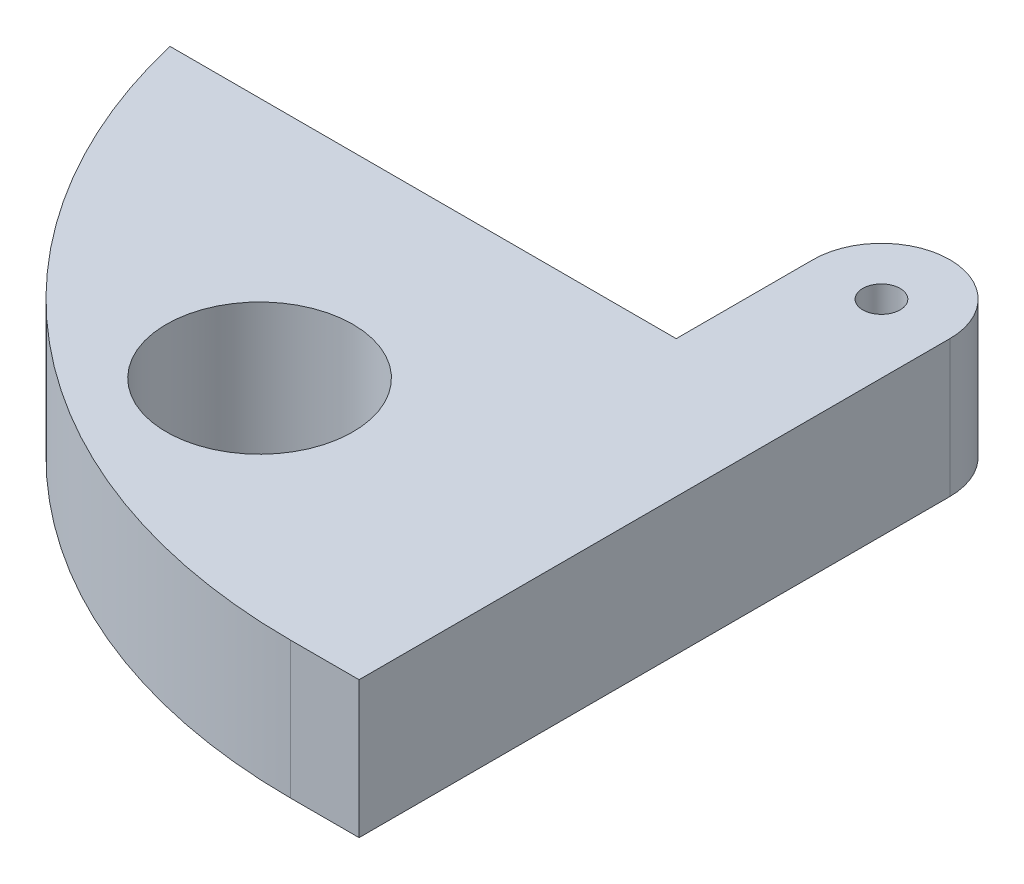
ISO-10303-21;
HEADER;
FILE_DESCRIPTION(('STEP AP214'),'2;1');
FILE_NAME('part.step','',(''),(''),'','','');
FILE_SCHEMA(('AUTOMOTIVE_DESIGN { 1 0 10303 214 1 1 1 1 }'));
ENDSEC;
DATA;
#1=APPLICATION_CONTEXT('core data for automotive mechanical design processes');
#2=APPLICATION_PROTOCOL_DEFINITION('international standard','automotive_design',2000,#1);
#3=PRODUCT_CONTEXT('',#1,'mechanical');
#4=PRODUCT('Part','Part','',(#3));
#5=PRODUCT_RELATED_PRODUCT_CATEGORY('part','',(#4));
#6=PRODUCT_DEFINITION_FORMATION('','',#4);
#7=PRODUCT_DEFINITION_CONTEXT('part definition',#1,'design');
#8=PRODUCT_DEFINITION('design','',#6,#7);
#9=PRODUCT_DEFINITION_SHAPE('','',#8);
#10=(LENGTH_UNIT() NAMED_UNIT(*) SI_UNIT(.MILLI.,.METRE.));
#11=(NAMED_UNIT(*) PLANE_ANGLE_UNIT() SI_UNIT($,.RADIAN.));
#12=(NAMED_UNIT(*) SI_UNIT($,.STERADIAN.) SOLID_ANGLE_UNIT());
#13=UNCERTAINTY_MEASURE_WITH_UNIT(LENGTH_MEASURE(1.E-05),#10,'distance_accuracy_value','');
#14=(GEOMETRIC_REPRESENTATION_CONTEXT(3) GLOBAL_UNCERTAINTY_ASSIGNED_CONTEXT((#13)) GLOBAL_UNIT_ASSIGNED_CONTEXT((#10,
#11,#12)) REPRESENTATION_CONTEXT('',''));
#15=CARTESIAN_POINT('',(0.,0.,0.));
#16=DIRECTION('',(0.,0.,1.));
#17=DIRECTION('',(1.,0.,0.));
#18=AXIS2_PLACEMENT_3D('',#15,#16,#17);
#19=CARTESIAN_POINT('',(0.,22.,0.));
#20=DIRECTION('',(0.,1.,0.));
#21=DIRECTION('',(0.,0.,1.));
#22=AXIS2_PLACEMENT_3D('',#19,#20,#21);
#23=PLANE('',#22);
#24=CARTESIAN_POINT('',(-39.,22.,61.));
#25=DIRECTION('',(0.,-1.,0.));
#26=DIRECTION('',(0.,0.,-1.));
#27=AXIS2_PLACEMENT_3D('',#24,#25,#26);
#28=CIRCLE('',#27,15.);
#29=CARTESIAN_POINT('',(-39.,22.,46.));
#30=VERTEX_POINT('',#29);
#31=EDGE_CURVE('E125',#30,#30,#28,.T.);
#32=ORIENTED_EDGE('',*,*,#31,.T.);
#33=EDGE_LOOP('',(#32));
#34=FACE_BOUND('',#33,.T.);
#35=CARTESIAN_POINT('',(0.,22.,0.));
#36=DIRECTION('',(0.,-1.,0.));
#37=DIRECTION('',(0.,0.,-1.));
#38=AXIS2_PLACEMENT_3D('',#35,#36,#37);
#39=CIRCLE('',#38,3.);
#40=CARTESIAN_POINT('',(0.,22.,-3.));
#41=VERTEX_POINT('',#40);
#42=EDGE_CURVE('E128',#41,#41,#39,.T.);
#43=ORIENTED_EDGE('',*,*,#42,.T.);
#44=EDGE_LOOP('',(#43));
#45=FACE_BOUND('',#44,.T.);
#46=DIRECTION('',(1.,0.,0.));
#47=VECTOR('',#46,1.);
#48=CARTESIAN_POINT('',(0.,22.,95.));
#49=LINE('',#48,#47);
#50=CARTESIAN_POINT('',(11.,22.,95.));
#51=VERTEX_POINT('',#50);
#52=CARTESIAN_POINT('',(0.,22.,95.));
#53=VERTEX_POINT('',#52);
#54=EDGE_CURVE('E64',#51,#53,#49,.F.);
#55=ORIENTED_EDGE('',*,*,#54,.F.);
#56=DIRECTION('',(0.,0.,-1.));
#57=VECTOR('',#56,1.);
#58=CARTESIAN_POINT('',(11.,22.,95.));
#59=LINE('',#58,#57);
#60=CARTESIAN_POINT('',(11.,22.,0.));
#61=VERTEX_POINT('',#60);
#62=EDGE_CURVE('E104',#61,#51,#59,.F.);
#63=ORIENTED_EDGE('',*,*,#62,.F.);
#64=CARTESIAN_POINT('',(0.,22.,0.));
#65=DIRECTION('',(0.,1.,0.));
#66=DIRECTION('',(0.,0.,1.));
#67=AXIS2_PLACEMENT_3D('',#64,#65,#66);
#68=CIRCLE('',#67,11.);
#69=CARTESIAN_POINT('',(-11.,22.,0.));
#70=VERTEX_POINT('',#69);
#71=EDGE_CURVE('E88',#70,#61,#68,.F.);
#72=ORIENTED_EDGE('',*,*,#71,.F.);
#73=DIRECTION('',(0.,0.,1.));
#74=VECTOR('',#73,1.);
#75=CARTESIAN_POINT('',(-11.,22.,0.));
#76=LINE('',#75,#74);
#77=CARTESIAN_POINT('',(-11.,22.,22.));
#78=VERTEX_POINT('',#77);
#79=EDGE_CURVE('E85',#78,#70,#76,.F.);
#80=ORIENTED_EDGE('',*,*,#79,.F.);
#81=DIRECTION('',(-1.,0.,0.));
#82=VECTOR('',#81,1.);
#83=CARTESIAN_POINT('',(-11.,22.,22.));
#84=LINE('',#83,#82);
#85=CARTESIAN_POINT('',(-92.4175308044962,22.,22.));
#86=VERTEX_POINT('',#85);
#87=EDGE_CURVE('E76',#86,#78,#84,.F.);
#88=ORIENTED_EDGE('',*,*,#87,.F.);
#89=CARTESIAN_POINT('',(0.,22.,0.));
#90=DIRECTION('',(0.,1.,0.));
#91=DIRECTION('',(0.,0.,1.));
#92=AXIS2_PLACEMENT_3D('',#89,#90,#91);
#93=CIRCLE('',#92,95.);
#94=EDGE_CURVE('E20',#53,#86,#93,.F.);
#95=ORIENTED_EDGE('',*,*,#94,.F.);
#96=EDGE_LOOP('',(#55,#63,#72,#80,#88,#95));
#97=FACE_BOUND('',#96,.T.);
#98=ADVANCED_FACE('F17',(#34,#45,#97),#23,.T.);
#99=CARTESIAN_POINT('',(-11.,0.,0.));
#100=DIRECTION('',(-1.,0.,0.));
#101=DIRECTION('',(0.,0.,1.));
#102=AXIS2_PLACEMENT_3D('',#99,#100,#101);
#103=PLANE('',#102);
#104=ORIENTED_EDGE('',*,*,#79,.T.);
#105=DIRECTION('',(0.,1.,0.));
#106=VECTOR('',#105,1.);
#107=CARTESIAN_POINT('',(-11.,0.,0.));
#108=LINE('',#107,#106);
#109=CARTESIAN_POINT('',(-11.,0.,0.));
#110=VERTEX_POINT('',#109);
#111=EDGE_CURVE('E130',#110,#70,#108,.T.);
#112=ORIENTED_EDGE('',*,*,#111,.F.);
#113=DIRECTION('',(0.,0.,1.));
#114=VECTOR('',#113,1.);
#115=CARTESIAN_POINT('',(-11.,0.,0.));
#116=LINE('',#115,#114);
#117=CARTESIAN_POINT('',(-11.,0.,22.));
#118=VERTEX_POINT('',#117);
#119=EDGE_CURVE('E95',#110,#118,#116,.T.);
#120=ORIENTED_EDGE('',*,*,#119,.T.);
#121=DIRECTION('',(0.,1.,0.));
#122=VECTOR('',#121,1.);
#123=CARTESIAN_POINT('',(-11.,0.,22.));
#124=LINE('',#123,#122);
#125=EDGE_CURVE('E81',#78,#118,#124,.F.);
#126=ORIENTED_EDGE('',*,*,#125,.F.);
#127=EDGE_LOOP('',(#104,#112,#120,#126));
#128=FACE_BOUND('',#127,.T.);
#129=ADVANCED_FACE('F94',(#128),#103,.T.);
#130=CARTESIAN_POINT('',(-11.,0.,22.));
#131=DIRECTION('',(0.,0.,-1.));
#132=DIRECTION('',(-1.,0.,0.));
#133=AXIS2_PLACEMENT_3D('',#130,#131,#132);
#134=PLANE('',#133);
#135=ORIENTED_EDGE('',*,*,#87,.T.);
#136=ORIENTED_EDGE('',*,*,#125,.T.);
#137=DIRECTION('',(1.,0.,0.));
#138=VECTOR('',#137,1.);
#139=CARTESIAN_POINT('',(0.,0.,22.));
#140=LINE('',#139,#138);
#141=CARTESIAN_POINT('',(-92.4175308044962,0.,22.));
#142=VERTEX_POINT('',#141);
#143=EDGE_CURVE('E124',#118,#142,#140,.F.);
#144=ORIENTED_EDGE('',*,*,#143,.T.);
#145=DIRECTION('',(0.,1.,0.));
#146=VECTOR('',#145,1.);
#147=CARTESIAN_POINT('',(-92.4175308044962,0.,22.));
#148=LINE('',#147,#146);
#149=EDGE_CURVE('E83',#86,#142,#148,.F.);
#150=ORIENTED_EDGE('',*,*,#149,.F.);
#151=EDGE_LOOP('',(#135,#136,#144,#150));
#152=FACE_BOUND('',#151,.T.);
#153=ADVANCED_FACE('F78',(#152),#134,.T.);
#154=CARTESIAN_POINT('',(0.,0.,0.));
#155=DIRECTION('',(0.,1.,0.));
#156=DIRECTION('',(0.,0.,1.));
#157=AXIS2_PLACEMENT_3D('',#154,#155,#156);
#158=CYLINDRICAL_SURFACE('',#157,95.);
#159=ORIENTED_EDGE('',*,*,#94,.T.);
#160=ORIENTED_EDGE('',*,*,#149,.T.);
#161=CARTESIAN_POINT('',(0.,0.,0.));
#162=DIRECTION('',(0.,1.,0.));
#163=DIRECTION('',(0.,0.,1.));
#164=AXIS2_PLACEMENT_3D('',#161,#162,#163);
#165=CIRCLE('',#164,95.);
#166=CARTESIAN_POINT('',(0.,0.,95.));
#167=VERTEX_POINT('',#166);
#168=EDGE_CURVE('E120',#142,#167,#165,.T.);
#169=ORIENTED_EDGE('',*,*,#168,.T.);
#170=DIRECTION('',(0.,1.,0.));
#171=VECTOR('',#170,1.);
#172=CARTESIAN_POINT('',(0.,0.,95.));
#173=LINE('',#172,#171);
#174=EDGE_CURVE('E107',#53,#167,#173,.F.);
#175=ORIENTED_EDGE('',*,*,#174,.F.);
#176=EDGE_LOOP('',(#159,#160,#169,#175));
#177=FACE_BOUND('',#176,.T.);
#178=ADVANCED_FACE('F146',(#177),#158,.T.);
#179=CARTESIAN_POINT('',(0.,0.,95.));
#180=DIRECTION('',(0.,0.,1.));
#181=DIRECTION('',(1.,0.,0.));
#182=AXIS2_PLACEMENT_3D('',#179,#180,#181);
#183=PLANE('',#182);
#184=ORIENTED_EDGE('',*,*,#54,.T.);
#185=ORIENTED_EDGE('',*,*,#174,.T.);
#186=DIRECTION('',(1.,0.,0.));
#187=VECTOR('',#186,1.);
#188=CARTESIAN_POINT('',(0.,0.,95.));
#189=LINE('',#188,#187);
#190=CARTESIAN_POINT('',(11.,0.,95.));
#191=VERTEX_POINT('',#190);
#192=EDGE_CURVE('E123',#167,#191,#189,.T.);
#193=ORIENTED_EDGE('',*,*,#192,.T.);
#194=DIRECTION('',(0.,1.,0.));
#195=VECTOR('',#194,1.);
#196=CARTESIAN_POINT('',(11.,0.,95.));
#197=LINE('',#196,#195);
#198=EDGE_CURVE('E106',#51,#191,#197,.F.);
#199=ORIENTED_EDGE('',*,*,#198,.F.);
#200=EDGE_LOOP('',(#184,#185,#193,#199));
#201=FACE_BOUND('',#200,.T.);
#202=ADVANCED_FACE('F139',(#201),#183,.T.);
#203=CARTESIAN_POINT('',(11.,0.,95.));
#204=DIRECTION('',(1.,0.,0.));
#205=DIRECTION('',(0.,0.,-1.));
#206=AXIS2_PLACEMENT_3D('',#203,#204,#205);
#207=PLANE('',#206);
#208=ORIENTED_EDGE('',*,*,#62,.T.);
#209=ORIENTED_EDGE('',*,*,#198,.T.);
#210=DIRECTION('',(0.,0.,1.));
#211=VECTOR('',#210,1.);
#212=CARTESIAN_POINT('',(11.,0.,0.));
#213=LINE('',#212,#211);
#214=CARTESIAN_POINT('',(11.,0.,0.));
#215=VERTEX_POINT('',#214);
#216=EDGE_CURVE('E119',#191,#215,#213,.F.);
#217=ORIENTED_EDGE('',*,*,#216,.T.);
#218=DIRECTION('',(0.,1.,0.));
#219=VECTOR('',#218,1.);
#220=CARTESIAN_POINT('',(11.,0.,0.));
#221=LINE('',#220,#219);
#222=EDGE_CURVE('E35',#61,#215,#221,.F.);
#223=ORIENTED_EDGE('',*,*,#222,.F.);
#224=EDGE_LOOP('',(#208,#209,#217,#223));
#225=FACE_BOUND('',#224,.T.);
#226=ADVANCED_FACE('F154',(#225),#207,.T.);
#227=CARTESIAN_POINT('',(0.,0.,0.));
#228=DIRECTION('',(0.,1.,0.));
#229=DIRECTION('',(0.,0.,1.));
#230=AXIS2_PLACEMENT_3D('',#227,#228,#229);
#231=CYLINDRICAL_SURFACE('',#230,11.);
#232=ORIENTED_EDGE('',*,*,#111,.T.);
#233=ORIENTED_EDGE('',*,*,#71,.T.);
#234=ORIENTED_EDGE('',*,*,#222,.T.);
#235=CARTESIAN_POINT('',(0.,0.,0.));
#236=DIRECTION('',(0.,1.,0.));
#237=DIRECTION('',(0.,0.,1.));
#238=AXIS2_PLACEMENT_3D('',#235,#236,#237);
#239=CIRCLE('',#238,11.);
#240=EDGE_CURVE('E117',#215,#110,#239,.T.);
#241=ORIENTED_EDGE('',*,*,#240,.T.);
#242=EDGE_LOOP('',(#232,#233,#234,#241));
#243=FACE_BOUND('',#242,.T.);
#244=ADVANCED_FACE('F172',(#243),#231,.T.);
#245=CARTESIAN_POINT('',(0.,149.717018664208,0.));
#246=DIRECTION('',(0.,-1.,0.));
#247=DIRECTION('',(0.,0.,-1.));
#248=AXIS2_PLACEMENT_3D('',#245,#246,#247);
#249=CYLINDRICAL_SURFACE('',#248,3.);
#250=CARTESIAN_POINT('',(0.,0.,0.));
#251=DIRECTION('',(0.,-1.,0.));
#252=DIRECTION('',(0.,0.,-1.));
#253=AXIS2_PLACEMENT_3D('',#250,#251,#252);
#254=CIRCLE('',#253,3.);
#255=CARTESIAN_POINT('',(0.,0.,-3.));
#256=VERTEX_POINT('',#255);
#257=EDGE_CURVE('E26',#256,#256,#254,.T.);
#258=ORIENTED_EDGE('',*,*,#257,.T.);
#259=EDGE_LOOP('',(#258));
#260=FACE_BOUND('',#259,.T.);
#261=ORIENTED_EDGE('',*,*,#42,.F.);
#262=EDGE_LOOP('',(#261));
#263=FACE_BOUND('',#262,.T.);
#264=ADVANCED_FACE('F164',(#260,#263),#249,.F.);
#265=CARTESIAN_POINT('',(-39.,22.,61.));
#266=DIRECTION('',(0.,-1.,0.));
#267=DIRECTION('',(0.,0.,-1.));
#268=AXIS2_PLACEMENT_3D('',#265,#266,#267);
#269=CYLINDRICAL_SURFACE('',#268,15.);
#270=ORIENTED_EDGE('',*,*,#31,.F.);
#271=EDGE_LOOP('',(#270));
#272=FACE_BOUND('',#271,.T.);
#273=CARTESIAN_POINT('',(-39.,0.,61.));
#274=DIRECTION('',(0.,-1.,0.));
#275=DIRECTION('',(0.,0.,-1.));
#276=AXIS2_PLACEMENT_3D('',#273,#274,#275);
#277=CIRCLE('',#276,15.);
#278=CARTESIAN_POINT('',(-39.,0.,46.));
#279=VERTEX_POINT('',#278);
#280=EDGE_CURVE('E11',#279,#279,#277,.T.);
#281=ORIENTED_EDGE('',*,*,#280,.T.);
#282=EDGE_LOOP('',(#281));
#283=FACE_BOUND('',#282,.T.);
#284=ADVANCED_FACE('F158',(#272,#283),#269,.F.);
#285=CARTESIAN_POINT('',(0.,0.,0.));
#286=DIRECTION('',(0.,1.,0.));
#287=DIRECTION('',(0.,0.,1.));
#288=AXIS2_PLACEMENT_3D('',#285,#286,#287);
#289=PLANE('',#288);
#290=ORIENTED_EDGE('',*,*,#280,.F.);
#291=EDGE_LOOP('',(#290));
#292=FACE_BOUND('',#291,.T.);
#293=ORIENTED_EDGE('',*,*,#257,.F.);
#294=EDGE_LOOP('',(#293));
#295=FACE_BOUND('',#294,.T.);
#296=ORIENTED_EDGE('',*,*,#216,.F.);
#297=ORIENTED_EDGE('',*,*,#192,.F.);
#298=ORIENTED_EDGE('',*,*,#168,.F.);
#299=ORIENTED_EDGE('',*,*,#143,.F.);
#300=ORIENTED_EDGE('',*,*,#119,.F.);
#301=ORIENTED_EDGE('',*,*,#240,.F.);
#302=EDGE_LOOP('',(#296,#297,#298,#299,#300,#301));
#303=FACE_BOUND('',#302,.T.);
#304=ADVANCED_FACE('F143',(#292,#295,#303),#289,.F.);
#305=CLOSED_SHELL('',(#98,#129,#153,#178,#202,#226,#244,#264,#284,#304));
#306=MANIFOLD_SOLID_BREP('B1',#305);
#307=ADVANCED_BREP_SHAPE_REPRESENTATION('',(#18,#306),#14);
#308=SHAPE_DEFINITION_REPRESENTATION(#9,#307);
ENDSEC;
END-ISO-10303-21;
